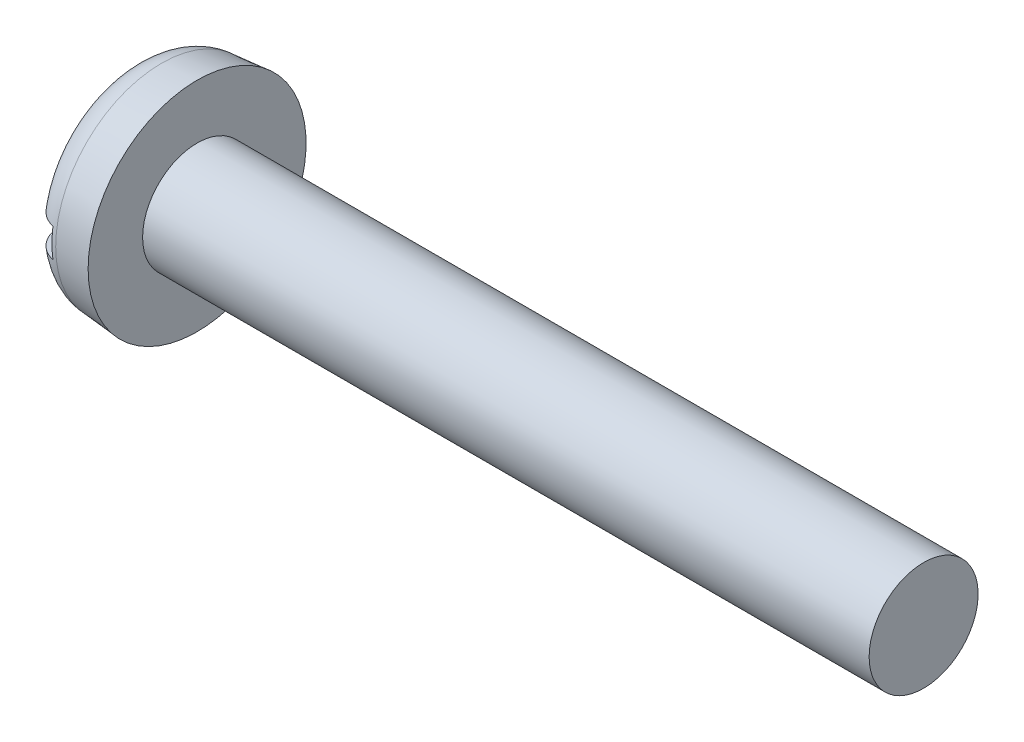
ISO-10303-21;
HEADER;
FILE_DESCRIPTION(('STEP AP214'),'2;1');
FILE_NAME('part.step','',(''),(''),'','','');
FILE_SCHEMA(('AUTOMOTIVE_DESIGN { 1 0 10303 214 1 1 1 1 }'));
ENDSEC;
DATA;
#1=APPLICATION_CONTEXT('core data for automotive mechanical design processes');
#2=APPLICATION_PROTOCOL_DEFINITION('international standard','automotive_design',2000,#1);
#3=PRODUCT_CONTEXT('',#1,'mechanical');
#4=PRODUCT('Part','Part','',(#3));
#5=PRODUCT_RELATED_PRODUCT_CATEGORY('part','',(#4));
#6=PRODUCT_DEFINITION_FORMATION('','',#4);
#7=PRODUCT_DEFINITION_CONTEXT('part definition',#1,'design');
#8=PRODUCT_DEFINITION('design','',#6,#7);
#9=PRODUCT_DEFINITION_SHAPE('','',#8);
#10=(LENGTH_UNIT() NAMED_UNIT(*) SI_UNIT(.MILLI.,.METRE.));
#11=(NAMED_UNIT(*) PLANE_ANGLE_UNIT() SI_UNIT($,.RADIAN.));
#12=(NAMED_UNIT(*) SI_UNIT($,.STERADIAN.) SOLID_ANGLE_UNIT());
#13=UNCERTAINTY_MEASURE_WITH_UNIT(LENGTH_MEASURE(1.E-05),#10,'distance_accuracy_value','');
#14=(GEOMETRIC_REPRESENTATION_CONTEXT(3) GLOBAL_UNCERTAINTY_ASSIGNED_CONTEXT((#13)) GLOBAL_UNIT_ASSIGNED_CONTEXT((#10,
#11,#12)) REPRESENTATION_CONTEXT('',''));
#15=CARTESIAN_POINT('',(0.,0.,0.));
#16=DIRECTION('',(0.,0.,1.));
#17=DIRECTION('',(1.,0.,0.));
#18=AXIS2_PLACEMENT_3D('',#15,#16,#17);
#19=CARTESIAN_POINT('',(0.,0.,0.));
#20=DIRECTION('',(-1.,0.,0.));
#21=DIRECTION('',(0.,0.,1.));
#22=AXIS2_PLACEMENT_3D('',#19,#20,#21);
#23=PLANE('',#22);
#24=DIRECTION('',(0.,0.,-1.));
#25=VECTOR('',#24,1.);
#26=CARTESIAN_POINT('',(0.,0.8,6.));
#27=LINE('',#26,#25);
#28=CARTESIAN_POINT('',(0.,0.8,3.9555566143216));
#29=VERTEX_POINT('',#28);
#30=CARTESIAN_POINT('',(0.,0.8,-3.9555566143216));
#31=VERTEX_POINT('',#30);
#32=EDGE_CURVE('E88',#29,#31,#27,.T.);
#33=ORIENTED_EDGE('',*,*,#32,.F.);
#34=CARTESIAN_POINT('',(0.,0.,0.));
#35=DIRECTION('',(-1.,0.,0.));
#36=DIRECTION('',(0.,0.,1.));
#37=AXIS2_PLACEMENT_3D('',#34,#35,#36);
#38=CIRCLE('',#37,4.03564469807531);
#39=EDGE_CURVE('E94',#29,#31,#38,.T.);
#40=ORIENTED_EDGE('',*,*,#39,.T.);
#41=EDGE_LOOP('',(#33,#40));
#42=FACE_BOUND('',#41,.T.);
#43=ADVANCED_FACE('F34',(#42),#23,.T.);
#44=CARTESIAN_POINT('',(-25.4,0.,0.));
#45=DIRECTION('',(-1.,0.,0.));
#46=DIRECTION('',(0.,0.,1.));
#47=AXIS2_PLACEMENT_3D('',#44,#45,#46);
#48=CYLINDRICAL_SURFACE('',#47,3.);
#49=CARTESIAN_POINT('',(43.6,0.,0.));
#50=DIRECTION('',(-1.,0.,0.));
#51=DIRECTION('',(0.,0.,1.));
#52=AXIS2_PLACEMENT_3D('',#49,#50,#51);
#53=CIRCLE('',#52,3.);
#54=CARTESIAN_POINT('',(43.6,0.,3.));
#55=VERTEX_POINT('',#54);
#56=EDGE_CURVE('E95',#55,#55,#53,.T.);
#57=ORIENTED_EDGE('',*,*,#56,.T.);
#58=EDGE_LOOP('',(#57));
#59=FACE_BOUND('',#58,.T.);
#60=CARTESIAN_POINT('',(3.6,0.,0.));
#61=DIRECTION('',(-1.,0.,0.));
#62=DIRECTION('',(0.,0.,1.));
#63=AXIS2_PLACEMENT_3D('',#60,#61,#62);
#64=CIRCLE('',#63,3.);
#65=CARTESIAN_POINT('',(3.6,0.,3.));
#66=VERTEX_POINT('',#65);
#67=EDGE_CURVE('E155',#66,#66,#64,.T.);
#68=ORIENTED_EDGE('',*,*,#67,.F.);
#69=EDGE_LOOP('',(#68));
#70=FACE_BOUND('',#69,.T.);
#71=ADVANCED_FACE('F143',(#59,#70),#48,.T.);
#72=CARTESIAN_POINT('',(43.6,3.,0.));
#73=DIRECTION('',(1.,0.,0.));
#74=DIRECTION('',(0.,0.,-1.));
#75=AXIS2_PLACEMENT_3D('',#72,#73,#74);
#76=PLANE('',#75);
#77=ORIENTED_EDGE('',*,*,#56,.F.);
#78=EDGE_LOOP('',(#77));
#79=FACE_BOUND('',#78,.T.);
#80=ADVANCED_FACE('F141',(#79),#76,.T.);
#81=DIRECTION('',(0.,0.,1.));
#82=VECTOR('',#81,1.);
#83=CARTESIAN_POINT('',(0.,-0.799999999999999,-6.));
#84=LINE('',#83,#82);
#85=CARTESIAN_POINT('',(0.,-0.799999999999999,-3.9555566143216));
#86=VERTEX_POINT('',#85);
#87=CARTESIAN_POINT('',(0.,-0.8,3.9555566143216));
#88=VERTEX_POINT('',#87);
#89=EDGE_CURVE('E79',#86,#88,#84,.T.);
#90=ORIENTED_EDGE('',*,*,#89,.F.);
#91=EDGE_CURVE('E86',#86,#88,#38,.T.);
#92=ORIENTED_EDGE('',*,*,#91,.T.);
#93=EDGE_LOOP('',(#90,#92));
#94=FACE_BOUND('',#93,.T.);
#95=ADVANCED_FACE('F85',(#94),#23,.T.);
#96=CARTESIAN_POINT('',(0.,0.,0.));
#97=DIRECTION('',(1.,0.,0.));
#98=DIRECTION('',(0.,0.,-1.));
#99=AXIS2_PLACEMENT_3D('',#96,#97,#98);
#100=CONICAL_SURFACE('',#99,5.68504081130667,0.0872664625997163);
#101=CARTESIAN_POINT('',(1.64311966305421,0.,0.));
#102=DIRECTION('',(-1.,0.,0.));
#103=DIRECTION('',(0.,0.,1.));
#104=AXIS2_PLACEMENT_3D('',#101,#102,#103);
#105=CIRCLE('',#104,5.82879515464045);
#106=CARTESIAN_POINT('',(1.64311966305421,0.,5.82879515464045));
#107=VERTEX_POINT('',#106);
#108=EDGE_CURVE('E98',#107,#107,#105,.F.);
#109=ORIENTED_EDGE('',*,*,#108,.T.);
#110=EDGE_LOOP('',(#109));
#111=FACE_BOUND('',#110,.T.);
#112=CARTESIAN_POINT('',(3.6,0.,0.));
#113=DIRECTION('',(-1.,0.,0.));
#114=DIRECTION('',(0.,0.,1.));
#115=AXIS2_PLACEMENT_3D('',#112,#113,#114);
#116=CIRCLE('',#115,6.);
#117=CARTESIAN_POINT('',(3.6,0.,6.));
#118=VERTEX_POINT('',#117);
#119=EDGE_CURVE('E100',#118,#118,#116,.T.);
#120=ORIENTED_EDGE('',*,*,#119,.T.);
#121=EDGE_LOOP('',(#120));
#122=FACE_BOUND('',#121,.T.);
#123=ADVANCED_FACE('F134',(#111,#122),#100,.T.);
#124=CARTESIAN_POINT('',(3.6,3.,0.));
#125=DIRECTION('',(-1.,0.,0.));
#126=DIRECTION('',(0.,0.,1.));
#127=AXIS2_PLACEMENT_3D('',#124,#125,#126);
#128=PLANE('',#127);
#129=ORIENTED_EDGE('',*,*,#119,.F.);
#130=EDGE_LOOP('',(#129));
#131=FACE_BOUND('',#130,.T.);
#132=ORIENTED_EDGE('',*,*,#67,.T.);
#133=EDGE_LOOP('',(#132));
#134=FACE_BOUND('',#133,.T.);
#135=ADVANCED_FACE('F130',(#131,#134),#128,.F.);
#136=CARTESIAN_POINT('',(1.8,0.,0.));
#137=DIRECTION('',(-1.,0.,0.));
#138=DIRECTION('',(0.,0.,1.));
#139=AXIS2_PLACEMENT_3D('',#136,#137,#138);
#140=TOROIDAL_SURFACE('',#139,4.03564469807531,1.8);
#141=CARTESIAN_POINT('',(0.79498247877104,0.8,-5.4707595964476));
#142=CARTESIAN_POINT('',(0.878021781411494,0.8,-5.52723570221117));
#143=CARTESIAN_POINT('',(0.965868273071982,0.8,-5.57676892397787));
#144=CARTESIAN_POINT('',(1.14869741387493,0.8,-5.66043534254259));
#145=CARTESIAN_POINT('',(1.24368800154579,0.8,-5.69455110348362));
#146=CARTESIAN_POINT('',(1.43803558818996,0.8,-5.74631528666983));
#147=CARTESIAN_POINT('',(1.53739129870275,0.8,-5.76396853443929));
#148=CARTESIAN_POINT('',(1.73763141508807,0.8,-5.78229150097843));
#149=CARTESIAN_POINT('',(1.83851545303786,0.8,-5.78296524429698));
#150=CARTESIAN_POINT('',(2.03871866229868,0.8,-5.76734047129323));
#151=CARTESIAN_POINT('',(2.13804097979698,0.8,-5.75108223962724));
#152=CARTESIAN_POINT('',(2.33255211629057,0.8,-5.70213397568044));
#153=CARTESIAN_POINT('',(2.42774081078532,0.8,-5.66944344884793));
#154=CARTESIAN_POINT('',(2.61137767784059,0.8,-5.58855650320202));
#155=CARTESIAN_POINT('',(2.69982013812151,0.8,-5.54034712040219));
#156=CARTESIAN_POINT('',(2.86741127340005,0.8,-5.42983917453441));
#157=CARTESIAN_POINT('',(2.94655981033097,0.8,-5.36754040220049));
#158=CARTESIAN_POINT('',(3.09379162808112,0.8,-5.23028659428212));
#159=CARTESIAN_POINT('',(3.16181323628872,0.8,-5.15526542146274));
#160=CARTESIAN_POINT('',(3.28444297285228,0.8,-4.99496665221733));
#161=CARTESIAN_POINT('',(3.33905060522622,0.8,-4.90968867671944));
#162=CARTESIAN_POINT('',(3.43391817009173,0.8,-4.73039134361488));
#163=CARTESIAN_POINT('',(3.47402767397714,0.8,-4.63629242164483));
#164=CARTESIAN_POINT('',(3.53813466297284,0.8,-4.44276184996656));
#165=CARTESIAN_POINT('',(3.5621310939402,0.8,-4.34332985181943));
#166=CARTESIAN_POINT('',(3.59373390423442,0.8,-4.14038478092645));
#167=CARTESIAN_POINT('',(3.60109179791735,0.8,-4.03683304431231));
#168=CARTESIAN_POINT('',(3.59864586257367,0.8,-3.82993528637962));
#169=CARTESIAN_POINT('',(3.5888404341772,0.8,-3.72658928513103));
#170=CARTESIAN_POINT('',(3.55214929440373,0.8,-3.52104210968037));
#171=CARTESIAN_POINT('',(3.52495742207498,0.8,-3.41889557837248));
#172=CARTESIAN_POINT('',(3.45407385845243,0.8,-3.22049320619653));
#173=CARTESIAN_POINT('',(3.41038022282177,0.8,-3.12423806104062));
#174=CARTESIAN_POINT('',(3.30693931611536,0.8,-2.93884573268063));
#175=CARTESIAN_POINT('',(3.24695855328808,0.8,-2.84983868909483));
#176=CARTESIAN_POINT('',(3.11285703415794,0.8,-2.6831725066266));
#177=CARTESIAN_POINT('',(3.03873462072239,0.8,-2.60551469954426));
#178=CARTESIAN_POINT('',(2.87857461311779,0.8,-2.46428120766053));
#179=CARTESIAN_POINT('',(2.79258245563154,0.8,-2.4006541183588));
#180=CARTESIAN_POINT('',(2.61075841872466,0.8,-2.2894705599418));
#181=CARTESIAN_POINT('',(2.51492959066773,0.8,-2.24190912673876));
#182=CARTESIAN_POINT('',(2.32040408907388,0.8,-2.16659600115229));
#183=CARTESIAN_POINT('',(2.22199896443323,0.8,-2.13809322445314));
#184=CARTESIAN_POINT('',(2.02168808214052,0.8,-2.09919204844837));
#185=CARTESIAN_POINT('',(1.91978414307377,0.8,-2.08878438484009));
#186=CARTESIAN_POINT('',(1.7218106948707,0.8,-2.08668375889815));
#187=CARTESIAN_POINT('',(1.62575089910533,0.8,-2.09392507457572));
#188=CARTESIAN_POINT('',(1.43624947629456,0.8,-2.12455680048217));
#189=CARTESIAN_POINT('',(1.34280792595818,0.8,-2.14794768334539));
#190=CARTESIAN_POINT('',(1.16164281790279,0.8,-2.20963276873043));
#191=CARTESIAN_POINT('',(1.0738881380438,0.8,-2.24783612052104));
#192=CARTESIAN_POINT('',(0.905572242928248,0.8,-2.33769901400144));
#193=CARTESIAN_POINT('',(0.825012624363653,0.8,-2.38936153256813));
#194=CARTESIAN_POINT('',(0.668796736037328,0.8,-2.50758066564676));
#195=CARTESIAN_POINT('',(0.593629818054888,0.8,-2.57478377070901));
#196=CARTESIAN_POINT('',(0.454960475513755,0.8,-2.72030593840466));
#197=CARTESIAN_POINT('',(0.391460875977256,0.8,-2.79862768509224));
#198=CARTESIAN_POINT('',(0.274732833001984,0.8,-2.9684902514541));
#199=CARTESIAN_POINT('',(0.222182729327836,0.8,-3.06049816269765));
#200=CARTESIAN_POINT('',(0.133007999981065,0.8,-3.25193849717045));
#201=CARTESIAN_POINT('',(0.0963850552592114,0.8,-3.35137170276757));
#202=CARTESIAN_POINT('',(0.0397382861104145,0.8,-3.55644918655703));
#203=CARTESIAN_POINT('',(0.0199665449510404,0.8,-3.66216331118301));
#204=CARTESIAN_POINT('',(-0.00133707228954608,0.8,-3.87541473590194));
#205=CARTESIAN_POINT('',(-0.00287033898764957,0.8,-3.98295189636897));
#206=CARTESIAN_POINT('',(0.0124328442644739,0.8,-4.19551973339952));
#207=CARTESIAN_POINT('',(0.0290662406091843,0.8,-4.3005649778431));
#208=CARTESIAN_POINT('',(0.0800769807812615,0.8,-4.50628962346019));
#209=CARTESIAN_POINT('',(0.114457174703788,0.8,-4.60696832056003));
#210=CARTESIAN_POINT('',(0.199309446403618,0.8,-4.79913251927606));
#211=CARTESIAN_POINT('',(0.249482144961682,0.8,-4.89075042342882));
#212=CARTESIAN_POINT('',(0.364709888648773,0.8,-5.06398311276304));
#213=CARTESIAN_POINT('',(0.429745119549729,0.8,-5.14561099580298));
#214=CARTESIAN_POINT('',(0.545565767507795,0.8,-5.26772828516504));
#215=CARTESIAN_POINT('',(0.59237011211439,0.8,-5.31206032585229));
#216=CARTESIAN_POINT('',(0.690451457372831,0.8,-5.39546656824515));
#217=CARTESIAN_POINT('',(0.741728416572756,0.8,-5.43454081867111));
#218=CARTESIAN_POINT('',(0.79498247877104,0.8,-5.4707595964476));
#219=B_SPLINE_CURVE_WITH_KNOTS('',3,(#141,#142,#143,#144,#145,#146,#147,#148,#149,#150,#151,
#152,#153,#154,#155,#156,#157,#158,#159,#160,#161,#162,#163,#164,#165,#166,#167,#168,#169,#170,
#171,#172,#173,#174,#175,#176,#177,#178,#179,#180,#181,#182,#183,#184,#185,#186,#187,#188,#189,
#190,#191,#192,#193,#194,#195,#196,#197,#198,#199,#200,#201,#202,#203,#204,#205,#206,#207,#208,
#209,#210,#211,#212,#213,#214,#215,#216,#217,#218),.UNSPECIFIED.,.T.,.F.,(4,2,2,2,2,2,2,2,2,2,2,
2,2,2,2,2,2,2,2,2,2,2,2,2,2,2,2,2,2,2,2,2,2,2,2,2,2,2,4),(0.,0.301039686168182,
0.602418976222948,0.903709897593573,1.20492940513451,1.50543388308322,1.80594740565397,
2.10671262252155,2.40748230686831,2.7098663617838,3.01226159567311,3.31770997067085,
3.62317832664211,3.933179344494,4.24320925143138,4.5588547812091,4.87453751384788,
5.1950094379763,5.51551893841425,5.83483392038979,6.15405014756491,6.4597992379228,
6.76539174527842,7.05299302358865,7.34060271921432,7.62647560561728,7.91241177468609,
8.21357015550234,8.51480136035,8.8312033120299,9.14763864864129,9.46872849100686,
9.78979385129078,10.1073069663005,10.4248710890632,10.7367449710122,11.0482054739601,
11.241267484682,11.434327706307),.UNSPECIFIED.);
#220=CARTESIAN_POINT('',(1.4,0.8,-5.73510972270059));
#221=VERTEX_POINT('',#220);
#222=EDGE_CURVE('E11',#31,#221,#219,.T.);
#223=ORIENTED_EDGE('',*,*,#222,.F.);
#224=ORIENTED_EDGE('',*,*,#39,.F.);
#225=CARTESIAN_POINT('',(0.738808862755957,0.8,2.45465275891893));
#226=CARTESIAN_POINT('',(0.81728090395036,0.8,2.39441521192629));
#227=CARTESIAN_POINT('',(0.900642588840665,0.8,2.34046573065824));
#228=CARTESIAN_POINT('',(1.07517756229069,0.8,2.24701568938401));
#229=CARTESIAN_POINT('',(1.16635530406727,0.8,2.2075234348571));
#230=CARTESIAN_POINT('',(1.35433647815522,0.8,2.14457447392871));
#231=CARTESIAN_POINT('',(1.4511512693026,0.8,2.12115145252577));
#232=CARTESIAN_POINT('',(1.64736626373892,0.8,2.09163161655544));
#233=CARTESIAN_POINT('',(1.74676535350718,0.8,2.08552746052977));
#234=CARTESIAN_POINT('',(1.94139815793727,0.8,2.09084288212209));
#235=CARTESIAN_POINT('',(2.0366500341865,0.8,2.10162308145853));
#236=CARTESIAN_POINT('',(2.22399259794412,0.8,2.13900058336874));
#237=CARTESIAN_POINT('',(2.3160829104002,0.8,2.16559975571637));
#238=CARTESIAN_POINT('',(2.49488785579145,0.8,2.23354429270444));
#239=CARTESIAN_POINT('',(2.58158846760124,0.8,2.2749263725107));
#240=CARTESIAN_POINT('',(2.74733008688126,0.8,2.37090149346887));
#241=CARTESIAN_POINT('',(2.82636936516146,0.8,2.4254975073737));
#242=CARTESIAN_POINT('',(2.97924384982255,0.8,2.54961694240126));
#243=CARTESIAN_POINT('',(3.05253911653726,0.8,2.61980548905359));
#244=CARTESIAN_POINT('',(3.18697089391559,0.8,2.77099535869646));
#245=CARTESIAN_POINT('',(3.24810458603162,0.8,2.85199918096601));
#246=CARTESIAN_POINT('',(3.35932367863329,0.8,3.02670877873326));
#247=CARTESIAN_POINT('',(3.40875290295072,0.8,3.12083317145552));
#248=CARTESIAN_POINT('',(3.49131343176022,0.8,3.31598315842183));
#249=CARTESIAN_POINT('',(3.5244433294817,0.8,3.41700934749294));
#250=CARTESIAN_POINT('',(3.57365832967891,0.8,3.62432183899235));
#251=CARTESIAN_POINT('',(3.58955155354412,0.8,3.73065384290518));
#252=CARTESIAN_POINT('',(3.60301925049771,0.8,3.94447654621399));
#253=CARTESIAN_POINT('',(3.6005945965361,0.8,4.05196719015045));
#254=CARTESIAN_POINT('',(3.57746920438561,0.8,4.26360682524416));
#255=CARTESIAN_POINT('',(3.55699765445138,0.8,4.36778080439547));
#256=CARTESIAN_POINT('',(3.49852167745952,0.8,4.57108923497054));
#257=CARTESIAN_POINT('',(3.46051891571931,0.8,4.67022416406882));
#258=CARTESIAN_POINT('',(3.36882575300776,0.8,4.85868839782682));
#259=CARTESIAN_POINT('',(3.31543802821706,0.8,4.9481649794392));
#260=CARTESIAN_POINT('',(3.1941696976945,0.8,5.11669149310859));
#261=CARTESIAN_POINT('',(3.12629038111124,0.8,5.19574235160981));
#262=CARTESIAN_POINT('',(2.97914164788937,0.8,5.33986050304074));
#263=CARTESIAN_POINT('',(2.90006974283139,0.8,5.40512951313778));
#264=CARTESIAN_POINT('',(2.73198870926708,0.8,5.52128982481106));
#265=CARTESIAN_POINT('',(2.64298022208824,0.8,5.57218205354675));
#266=CARTESIAN_POINT('',(2.45861045172921,0.8,5.65758147057975));
#267=CARTESIAN_POINT('',(2.36332949666704,0.8,5.6922621433757));
#268=CARTESIAN_POINT('',(2.16827799846028,0.8,5.74502563142979));
#269=CARTESIAN_POINT('',(2.06850763162037,0.8,5.76310909788479));
#270=CARTESIAN_POINT('',(1.8679544932308,0.8,5.78208130821785));
#271=CARTESIAN_POINT('',(1.76718145389007,0.8,5.78307307619952));
#272=CARTESIAN_POINT('',(1.5669047405792,0.8,5.7680972223928));
#273=CARTESIAN_POINT('',(1.4674010466573,0.8,5.75212986750365));
#274=CARTESIAN_POINT('',(1.27263042539357,0.8,5.70374269353348));
#275=CARTESIAN_POINT('',(1.17735767343021,0.8,5.67134630691868));
#276=CARTESIAN_POINT('',(0.993580598251401,0.8,5.59106523356246));
#277=CARTESIAN_POINT('',(0.905076306964469,0.8,5.54318047376411));
#278=CARTESIAN_POINT('',(0.73704277782332,0.8,5.43315060198027));
#279=CARTESIAN_POINT('',(0.657541732800566,0.8,5.37096244781723));
#280=CARTESIAN_POINT('',(0.51001197867511,0.8,5.23421401355587));
#281=CARTESIAN_POINT('',(0.441983591122382,0.8,5.15965338680417));
#282=CARTESIAN_POINT('',(0.318749447897985,0.8,4.99968518214277));
#283=CARTESIAN_POINT('',(0.263645836994494,0.8,4.91419893921519));
#284=CARTESIAN_POINT('',(0.168372115433642,0.8,4.73527874468894));
#285=CARTESIAN_POINT('',(0.12820281746382,0.8,4.64184436091241));
#286=CARTESIAN_POINT('',(0.0633758760382894,0.8,4.44844396926919));
#287=CARTESIAN_POINT('',(0.0389181726903435,0.8,4.34841097418927));
#288=CARTESIAN_POINT('',(0.00684497615367615,0.8,4.14568821972825));
#289=CARTESIAN_POINT('',(-0.000769843685637645,0.8,4.0429983542961));
#290=CARTESIAN_POINT('',(0.000906696644069946,0.8,3.83604122241814));
#291=CARTESIAN_POINT('',(0.0104828796453908,0.8,3.73177629209953));
#292=CARTESIAN_POINT('',(0.0466864843917509,0.8,3.52622451606567));
#293=CARTESIAN_POINT('',(0.0733195200020884,0.8,3.42493866232764));
#294=CARTESIAN_POINT('',(0.143440652938328,0.8,3.22628956859382));
#295=CARTESIAN_POINT('',(0.187229198277411,0.8,3.12903247421492));
#296=CARTESIAN_POINT('',(0.290347973800745,0.8,2.94321898474456));
#297=CARTESIAN_POINT('',(0.349664024043149,0.8,2.85465475214756));
#298=CARTESIAN_POINT('',(0.463120486540268,0.8,2.71261986375551));
#299=CARTESIAN_POINT('',(0.513841235261762,0.8,2.6563828294548));
#300=CARTESIAN_POINT('',(0.621691862489933,0.8,2.5504233045694));
#301=CARTESIAN_POINT('',(0.678821685219908,0.8,2.50070075729878));
#302=CARTESIAN_POINT('',(0.738808862755957,0.8,2.45465275891893));
#303=B_SPLINE_CURVE_WITH_KNOTS('',3,(#225,#226,#227,#228,#229,#230,#231,#232,#233,#234,#235,
#236,#237,#238,#239,#240,#241,#242,#243,#244,#245,#246,#247,#248,#249,#250,#251,#252,#253,#254,
#255,#256,#257,#258,#259,#260,#261,#262,#263,#264,#265,#266,#267,#268,#269,#270,#271,#272,#273,
#274,#275,#276,#277,#278,#279,#280,#281,#282,#283,#284,#285,#286,#287,#288,#289,#290,#291,#292,
#293,#294,#295,#296,#297,#298,#299,#300,#301,#302),.UNSPECIFIED.,.T.,.F.,(4,2,2,2,2,2,2,2,2,2,2,
2,2,2,2,2,2,2,2,2,2,2,2,2,2,2,2,2,2,2,2,2,2,2,2,2,2,2,4),(0.,0.296525421879765,
0.593220927221168,0.890536493145869,1.18772600830897,1.4739307093563,1.76016924600428,
2.0471236910243,2.33414275259769,2.63724803752002,2.94042348802224,3.25788178582408,
3.57536747817383,3.89635224970986,4.21732172461102,4.53427280846465,4.85119379083326,
5.16226196234397,5.47330247325445,5.77941469908211,6.08550717920575,6.38824453070312,
6.69097000369295,6.99187008741655,7.29276543570569,7.59323282372481,7.89370162903606,
8.19508672548803,8.49648026760921,8.80018100172884,9.10389826005622,9.4114077171392,
9.71892946769725,10.0315933889897,10.3443602692422,10.6628688953917,10.9810876634535,
11.2077655686962,11.4344415013661),.UNSPECIFIED.);
#304=CARTESIAN_POINT('',(1.4,0.8,5.73510972270059));
#305=VERTEX_POINT('',#304);
#306=EDGE_CURVE('E113',#305,#29,#303,.T.);
#307=ORIENTED_EDGE('',*,*,#306,.F.);
#308=CARTESIAN_POINT('',(1.4,0.,0.));
#309=DIRECTION('',(-1.,0.,0.));
#310=DIRECTION('',(0.,0.,1.));
#311=AXIS2_PLACEMENT_3D('',#308,#309,#310);
#312=CIRCLE('',#311,5.79063757555374);
#313=CARTESIAN_POINT('',(1.4,-0.800000000000001,5.73510972270059));
#314=VERTEX_POINT('',#313);
#315=EDGE_CURVE('E106',#305,#314,#312,.F.);
#316=ORIENTED_EDGE('',*,*,#315,.T.);
#317=CARTESIAN_POINT('',(0.738808862755957,-0.8,2.45465275891893));
#318=CARTESIAN_POINT('',(0.654650583055117,-0.8,2.51926355200935));
#319=CARTESIAN_POINT('',(0.575997154507916,-0.8,2.59120474064522));
#320=CARTESIAN_POINT('',(0.431815168763476,-0.8,2.74736316186492));
#321=CARTESIAN_POINT('',(0.36631031753961,-0.8,2.8316021025952));
#322=CARTESIAN_POINT('',(0.250316246376519,-0.8,3.009705251625));
#323=CARTESIAN_POINT('',(0.199807521812913,-0.8,3.10355674170627));
#324=CARTESIAN_POINT('',(0.115117819347704,-0.8,3.29830977965815));
#325=CARTESIAN_POINT('',(0.0809300590553323,-0.8,3.3992083789932));
#326=CARTESIAN_POINT('',(0.0296583318607302,-0.8,3.60624688426383));
#327=CARTESIAN_POINT('',(0.0127325581965296,-0.8,3.71242607640928));
#328=CARTESIAN_POINT('',(-0.00282059226024313,-0.8,3.92613069484577));
#329=CARTESIAN_POINT('',(-0.00144724951808501,-0.8,4.03365617390772));
#330=CARTESIAN_POINT('',(0.0196066503939876,-0.8,4.24558329071084));
#331=CARTESIAN_POINT('',(0.0390643203732083,-0.8,4.35000701693892));
#332=CARTESIAN_POINT('',(0.0955698891766116,-0.8,4.55398403037389));
#333=CARTESIAN_POINT('',(0.132615965613485,-0.800000000000001,4.65353782099084));
#334=CARTESIAN_POINT('',(0.222500685271957,-0.800000000000001,4.84299035279221));
#335=CARTESIAN_POINT('',(0.275035271322079,-0.800000000000001,4.93303336698085));
#336=CARTESIAN_POINT('',(0.394708301490632,-0.800000000000001,5.10282845383517));
#337=CARTESIAN_POINT('',(0.461845417248886,-0.800000000000001,5.18258146150956));
#338=CARTESIAN_POINT('',(0.607645323476716,-0.800000000000001,5.32819694031435));
#339=CARTESIAN_POINT('',(0.686106942121359,-0.800000000000001,5.39426088983188));
#340=CARTESIAN_POINT('',(0.853112769851129,-0.800000000000001,5.51210096889903));
#341=CARTESIAN_POINT('',(0.941656334167567,-0.800000000000001,5.56387801141222));
#342=CARTESIAN_POINT('',(1.12524607600852,-0.800000000000001,5.6510932518933));
#343=CARTESIAN_POINT('',(1.22020911334482,-0.800000000000001,5.68670652436378));
#344=CARTESIAN_POINT('',(1.41478737039854,-0.800000000000001,5.74137307155477));
#345=CARTESIAN_POINT('',(1.51440240195487,-0.800000000000001,5.76042701544689));
#346=CARTESIAN_POINT('',(1.71479811916751,-0.800000000000001,5.78134157318957));
#347=CARTESIAN_POINT('',(1.81556783088549,-0.800000000000001,5.78330747099474));
#348=CARTESIAN_POINT('',(2.01600141400791,-0.800000000000001,5.77026427909424));
#349=CARTESIAN_POINT('',(2.11566530359843,-0.800000000000001,5.75525546896959));
#350=CARTESIAN_POINT('',(2.31090109323454,-0.800000000000001,5.70874330749071));
#351=CARTESIAN_POINT('',(2.40647909983843,-0.800000000000001,5.67726557367507));
#352=CARTESIAN_POINT('',(2.59101515513862,-0.800000000000001,5.5987556915629));
#353=CARTESIAN_POINT('',(2.6799731723359,-0.800000000000001,5.55172346926131));
#354=CARTESIAN_POINT('',(2.84903871310012,-0.800000000000001,5.44331774507961));
#355=CARTESIAN_POINT('',(2.92911962412076,-0.800000000000001,5.38190275174589));
#356=CARTESIAN_POINT('',(3.07792799416342,-0.800000000000001,5.24659163238861));
#357=CARTESIAN_POINT('',(3.14665515144413,-0.800000000000001,5.17269517475887));
#358=CARTESIAN_POINT('',(3.27138174251225,-0.800000000000001,5.01394352244095));
#359=CARTESIAN_POINT('',(3.3272815438209,-0.800000000000001,4.9290100729891));
#360=CARTESIAN_POINT('',(3.42422579657859,-0.800000000000001,4.75105518441382));
#361=CARTESIAN_POINT('',(3.46526950944318,-0.8,4.65803334345342));
#362=CARTESIAN_POINT('',(3.53190401728387,-0.8,4.46532684164714));
#363=CARTESIAN_POINT('',(3.55729802608939,-0.8,4.36557416709264));
#364=CARTESIAN_POINT('',(3.59127645137186,-0.8,4.1632497054257));
#365=CARTESIAN_POINT('',(3.5998595424972,-0.8,4.06067769668687));
#366=CARTESIAN_POINT('',(3.60013933774861,-0.8,3.85379739111221));
#367=CARTESIAN_POINT('',(3.59155138006068,-0.8,3.74948873071031));
#368=CARTESIAN_POINT('',(3.5573082981875,-0.8,3.54371261301965));
#369=CARTESIAN_POINT('',(3.53165142447631,-0.8,3.44224544808895));
#370=CARTESIAN_POINT('',(3.46346864050295,-0.8,3.24309833787712));
#371=CARTESIAN_POINT('',(3.42064732476672,-0.8,3.14551947320841));
#372=CARTESIAN_POINT('',(3.31938145930648,-0.8,2.95882192492474));
#373=CARTESIAN_POINT('',(3.2609347742414,-0.8,2.869704399882));
#374=CARTESIAN_POINT('',(3.12937338988563,-0.8,2.70170920822213));
#375=CARTESIAN_POINT('',(3.05612986304229,-0.8,2.62293226860331));
#376=CARTESIAN_POINT('',(2.8972168945846,-0.8,2.47906700491505));
#377=CARTESIAN_POINT('',(2.81154754330461,-0.8,2.41397858134005));
#378=CARTESIAN_POINT('',(2.63189040045543,-0.8,2.30102582091958));
#379=CARTESIAN_POINT('',(2.53810397909863,-0.8,2.25284212510418));
#380=CARTESIAN_POINT('',(2.34344297143819,-0.8,2.17400509511495));
#381=CARTESIAN_POINT('',(2.24257253716404,-0.8,2.14334158685309));
#382=CARTESIAN_POINT('',(2.04279712186911,-0.8,2.10230574896057));
#383=CARTESIAN_POINT('',(1.94410975503258,-0.8,2.09087307915656));
#384=CARTESIAN_POINT('',(1.74624615337143,-0.8,2.08555744033791));
#385=CARTESIAN_POINT('',(1.64706991502979,-0.8,2.09167459776435));
#386=CARTESIAN_POINT('',(1.45542384334905,-0.8,2.12051019981731));
#387=CARTESIAN_POINT('',(1.3628466234854,-0.8,2.14252778306014));
#388=CARTESIAN_POINT('',(1.18262126888773,-0.8,2.20137783147465));
#389=CARTESIAN_POINT('',(1.09496796407233,-0.8,2.23819441338274));
#390=CARTESIAN_POINT('',(0.963037962464619,-0.8,2.30638349216341));
#391=CARTESIAN_POINT('',(0.916369023755198,-0.8,2.3332465613576));
#392=CARTESIAN_POINT('',(0.825597706014433,-0.8,2.39099554147401));
#393=CARTESIAN_POINT('',(0.781495176879087,-0.8,2.42188121677945));
#394=CARTESIAN_POINT('',(0.738808862755957,-0.8,2.45465275891893));
#395=B_SPLINE_CURVE_WITH_KNOTS('',3,(#317,#318,#319,#320,#321,#322,#323,#324,#325,#326,#327,
#328,#329,#330,#331,#332,#333,#334,#335,#336,#337,#338,#339,#340,#341,#342,#343,#344,#345,#346,
#347,#348,#349,#350,#351,#352,#353,#354,#355,#356,#357,#358,#359,#360,#361,#362,#363,#364,#365,
#366,#367,#368,#369,#370,#371,#372,#373,#374,#375,#376,#377,#378,#379,#380,#381,#382,#383,#384,
#385,#386,#387,#388,#389,#390,#391,#392,#393,#394),.UNSPECIFIED.,.T.,.F.,(4,2,2,2,2,2,2,2,2,2,2,
2,2,2,2,2,2,2,2,2,2,2,2,2,2,2,2,2,2,2,2,2,2,2,2,2,2,2,4),(0.,0.318096966555204,
0.636762388022819,0.955011504993438,1.27312825399636,1.5941347977512,1.91515396375694,
2.23226833960722,2.54934986545845,2.86057987462294,3.17178158370673,3.47801376370799,
3.78422637029096,4.08703814654055,4.38983768543022,4.69077026406685,4.99169788628148,
5.29215879886352,5.59262114099759,5.89396117349583,6.19530921322313,6.49892412268796,
6.80255412458165,7.1099281031531,7.41732631372756,7.7298628252778,8.04243137606175,
8.36062764356313,8.67886741756838,9.0000075854677,9.32114541883081,9.63584044474821,
9.95035253897744,10.2468743381193,10.5433982736144,10.8275926757549,11.1114828726278,
11.272835767465,11.4341792155994),.UNSPECIFIED.);
#396=EDGE_CURVE('E93',#88,#314,#395,.T.);
#397=ORIENTED_EDGE('',*,*,#396,.F.);
#398=ORIENTED_EDGE('',*,*,#91,.F.);
#399=CARTESIAN_POINT('',(0.79498247877104,-0.799999999999999,-5.4707595964476));
#400=CARTESIAN_POINT('',(0.710907891323877,-0.799999999999999,-5.41356815358587));
#401=CARTESIAN_POINT('',(0.631636792734366,-0.799999999999999,-5.34917273049206));
#402=CARTESIAN_POINT('',(0.485010326699633,-0.799999999999999,-5.20788964596421));
#403=CARTESIAN_POINT('',(0.417670906107772,-0.799999999999999,-5.13098552571741));
#404=CARTESIAN_POINT('',(0.296888380145856,-0.799999999999999,-4.96705901425213));
#405=CARTESIAN_POINT('',(0.243431497628102,-0.799999999999999,-4.88004677952456));
#406=CARTESIAN_POINT('',(0.151745205646662,-0.799999999999999,-4.69837825189746));
#407=CARTESIAN_POINT('',(0.113511967409671,-0.799999999999999,-4.6037238882189));
#408=CARTESIAN_POINT('',(0.0528834531892175,-0.799999999999999,-4.40846960986465));
#409=CARTESIAN_POINT('',(0.0306450595596877,-0.799999999999999,-4.30782101449094));
#410=CARTESIAN_POINT('',(0.00307493878516673,-0.799999999999999,-4.10423364300225));
#411=CARTESIAN_POINT('',(-0.00225473294801675,-0.799999999999999,-4.00129458999238));
#412=CARTESIAN_POINT('',(0.00403799739584608,-0.799999999999999,-3.79418040397016));
#413=CARTESIAN_POINT('',(0.0159509657148701,-0.8,-3.69001411831486));
#414=CARTESIAN_POINT('',(0.0567787653112254,-0.8,-3.48506907005109));
#415=CARTESIAN_POINT('',(0.0856953626478656,-0.8,-3.38429066046947));
#416=CARTESIAN_POINT('',(0.160302424847598,-0.8,-3.18709231927843));
#417=CARTESIAN_POINT('',(0.20628160150372,-0.8,-3.09078154558585));
#418=CARTESIAN_POINT('',(0.313636026750759,-0.8,-2.90714440962693));
#419=CARTESIAN_POINT('',(0.375013360652988,-0.8,-2.81981926650946));
#420=CARTESIAN_POINT('',(0.512046260293362,-0.8,-2.65608314481877));
#421=CARTESIAN_POINT('',(0.587803081785792,-0.8,-2.57975676239328));
#422=CARTESIAN_POINT('',(0.751330376374635,-0.8,-2.44125203686856));
#423=CARTESIAN_POINT('',(0.839100200104579,-0.8,-2.37907292951746));
#424=CARTESIAN_POINT('',(1.02206633912813,-0.8,-2.2725165647621));
#425=CARTESIAN_POINT('',(1.1170344531487,-0.8,-2.22774862958171));
#426=CARTESIAN_POINT('',(1.31344292854339,-0.8,-2.15594100494522));
#427=CARTESIAN_POINT('',(1.41487965549416,-0.8,-2.12889145496631));
#428=CARTESIAN_POINT('',(1.61491882110146,-0.8,-2.09494929717525));
#429=CARTESIAN_POINT('',(1.71333611414886,-0.8,-2.08696295121274));
#430=CARTESIAN_POINT('',(1.9100385143274,-0.8,-2.08833434327531));
#431=CARTESIAN_POINT('',(2.00832364459925,-0.8,-2.0976884923045));
#432=CARTESIAN_POINT('',(2.19822111943174,-0.8,-2.13259379476932));
#433=CARTESIAN_POINT('',(2.28994603514312,-0.8,-2.15753980272288));
#434=CARTESIAN_POINT('',(2.46812389762464,-0.8,-2.22198466663684));
#435=CARTESIAN_POINT('',(2.55457589924743,-0.8,-2.2614861227164));
#436=CARTESIAN_POINT('',(2.72291323352503,-0.8,-2.35511870956095));
#437=CARTESIAN_POINT('',(2.80455290045133,-0.8,-2.40969056063492));
#438=CARTESIAN_POINT('',(2.95818485453464,-0.8,-2.53104113185355));
#439=CARTESIAN_POINT('',(3.03017474151008,-0.8,-2.59782287922699));
#440=CARTESIAN_POINT('',(3.16684972907403,-0.8,-2.7459880769244));
#441=CARTESIAN_POINT('',(3.23085427169728,-0.8,-2.82800012560218));
#442=CARTESIAN_POINT('',(3.34469042679389,-0.8,-3.0013372886757));
#443=CARTESIAN_POINT('',(3.39451951793786,-0.8,-3.09266405592271));
#444=CARTESIAN_POINT('',(3.47999879247641,-0.8,-3.28515109111578));
#445=CARTESIAN_POINT('',(3.51516128327077,-0.8,-3.38652849551075));
#446=CARTESIAN_POINT('',(3.56793278653316,-0.8,-3.59375906551803));
#447=CARTESIAN_POINT('',(3.58554152761552,-0.799999999999999,-3.6996123003015));
#448=CARTESIAN_POINT('',(3.60253267192658,-0.799999999999999,-3.91255666810797));
#449=CARTESIAN_POINT('',(3.60195332971081,-0.799999999999999,-4.01964472945692));
#450=CARTESIAN_POINT('',(3.58250136913395,-0.799999999999999,-4.23215040977986));
#451=CARTESIAN_POINT('',(3.56363020016857,-0.799999999999999,-4.3375681604322));
#452=CARTESIAN_POINT('',(3.50845655001546,-0.799999999999999,-4.541832290491));
#453=CARTESIAN_POINT('',(3.47245352282421,-0.799999999999999,-4.64075953021548));
#454=CARTESIAN_POINT('',(3.38405219361766,-0.799999999999999,-4.83099829100706));
#455=CARTESIAN_POINT('',(3.33165544184455,-0.799999999999999,-4.92231053113882));
#456=CARTESIAN_POINT('',(3.21297961094559,-0.799999999999999,-5.09300071142656));
#457=CARTESIAN_POINT('',(3.14696502206293,-0.799999999999999,-5.17256258245392));
#458=CARTESIAN_POINT('',(3.00234707732374,-0.799999999999999,-5.31927970359609));
#459=CARTESIAN_POINT('',(2.92374468747096,-0.799999999999999,-5.38643590488672));
#460=CARTESIAN_POINT('',(2.75735615533563,-0.799999999999999,-5.50548196335812));
#461=CARTESIAN_POINT('',(2.66971064868928,-0.799999999999999,-5.55756844228502));
#462=CARTESIAN_POINT('',(2.4868646574207,-0.799999999999999,-5.64613551498809));
#463=CARTESIAN_POINT('',(2.39166488217978,-0.799999999999999,-5.68261757204168));
#464=CARTESIAN_POINT('',(2.19731523311712,-0.799999999999999,-5.73863546208328));
#465=CARTESIAN_POINT('',(2.09820754196021,-0.799999999999999,-5.75831774018658));
#466=CARTESIAN_POINT('',(1.89806476285629,-0.799999999999999,-5.78069531913944));
#467=CARTESIAN_POINT('',(1.79702923537925,-0.799999999999999,-5.78338669865177));
#468=CARTESIAN_POINT('',(1.59630713762877,-0.799999999999999,-5.7717182772957));
#469=CARTESIAN_POINT('',(1.49661713234888,-0.799999999999999,-5.75741684613152));
#470=CARTESIAN_POINT('',(1.3011428703224,-0.799999999999999,-5.71228636037468));
#471=CARTESIAN_POINT('',(1.20535385768217,-0.799999999999999,-5.68147812119757));
#472=CARTESIAN_POINT('',(1.05716264119848,-0.799999999999999,-5.61967030184329));
#473=CARTESIAN_POINT('',(1.00264579680923,-0.799999999999999,-5.59361192627646));
#474=CARTESIAN_POINT('',(0.89651564870589,-0.799999999999999,-5.53613546862752));
#475=CARTESIAN_POINT('',(0.844902335653026,-0.799999999999999,-5.50471740378536));
#476=CARTESIAN_POINT('',(0.79498247877104,-0.799999999999999,-5.4707595964476));
#477=B_SPLINE_CURVE_WITH_KNOTS('',3,(#399,#400,#401,#402,#403,#404,#405,#406,#407,#408,#409,
#410,#411,#412,#413,#414,#415,#416,#417,#418,#419,#420,#421,#422,#423,#424,#425,#426,#427,#428,
#429,#430,#431,#432,#433,#434,#435,#436,#437,#438,#439,#440,#441,#442,#443,#444,#445,#446,#447,
#448,#449,#450,#451,#452,#453,#454,#455,#456,#457,#458,#459,#460,#461,#462,#463,#464,#465,#466,
#467,#468,#469,#470,#471,#472,#473,#474,#475,#476),.UNSPECIFIED.,.T.,.F.,(4,2,2,2,2,2,2,2,2,2,2,
2,2,2,2,2,2,2,2,2,2,2,2,2,2,2,2,2,2,2,2,2,2,2,2,2,2,2,4),(0.,0.304824877060542,
0.610054133239165,0.914979309673264,1.21982774837651,1.52762690542925,1.83546347688799,
2.14854837504621,2.46166579709607,2.7803427669919,3.09906291736345,3.42011676247522,
3.74115325977333,4.05450115903388,4.3676745274292,4.66239580535927,4.95705609106519,
5.24093521958144,5.52486508357958,5.81818726658681,6.11158227252575,6.42226861424223,
6.73301018196235,7.05338942940951,7.37377362992901,7.69348401934565,8.01316907783175,
8.32746074712311,8.6417227049832,8.95037516837115,9.25900395671956,9.5634027519042,
9.86777299636195,10.1694621034559,10.4712208349714,10.7719460254164,11.0722928848289,
11.2532853064934,11.4342771459895),.UNSPECIFIED.);
#478=CARTESIAN_POINT('',(1.4,-0.799999999999999,-5.73510972270059));
#479=VERTEX_POINT('',#478);
#480=EDGE_CURVE('E47',#479,#86,#477,.T.);
#481=ORIENTED_EDGE('',*,*,#480,.F.);
#482=EDGE_CURVE('E59',#479,#221,#312,.F.);
#483=ORIENTED_EDGE('',*,*,#482,.T.);
#484=EDGE_LOOP('',(#223,#224,#307,#316,#397,#398,#481,#483));
#485=FACE_BOUND('',#484,.T.);
#486=ORIENTED_EDGE('',*,*,#108,.F.);
#487=EDGE_LOOP('',(#486));
#488=FACE_BOUND('',#487,.T.);
#489=ADVANCED_FACE('F36',(#485,#488),#140,.T.);
#490=CARTESIAN_POINT('',(1.4,0.8,6.));
#491=DIRECTION('',(0.,1.,0.));
#492=DIRECTION('',(0.,0.,1.));
#493=AXIS2_PLACEMENT_3D('',#490,#491,#492);
#494=PLANE('',#493);
#495=ORIENTED_EDGE('',*,*,#222,.T.);
#496=DIRECTION('',(0.,0.,-1.));
#497=VECTOR('',#496,1.);
#498=CARTESIAN_POINT('',(1.4,0.8,6.));
#499=LINE('',#498,#497);
#500=EDGE_CURVE('E87',#305,#221,#499,.T.);
#501=ORIENTED_EDGE('',*,*,#500,.F.);
#502=ORIENTED_EDGE('',*,*,#306,.T.);
#503=ORIENTED_EDGE('',*,*,#32,.T.);
#504=EDGE_LOOP('',(#495,#501,#502,#503));
#505=FACE_BOUND('',#504,.T.);
#506=ADVANCED_FACE('F121',(#505),#494,.F.);
#507=CARTESIAN_POINT('',(1.4,-0.799999999999999,-6.));
#508=DIRECTION('',(0.,-1.,0.));
#509=DIRECTION('',(0.,0.,-1.));
#510=AXIS2_PLACEMENT_3D('',#507,#508,#509);
#511=PLANE('',#510);
#512=ORIENTED_EDGE('',*,*,#480,.T.);
#513=ORIENTED_EDGE('',*,*,#89,.T.);
#514=ORIENTED_EDGE('',*,*,#396,.T.);
#515=DIRECTION('',(0.,0.,1.));
#516=VECTOR('',#515,1.);
#517=CARTESIAN_POINT('',(1.4,-0.799999999999999,-6.));
#518=LINE('',#517,#516);
#519=EDGE_CURVE('E54',#479,#314,#518,.T.);
#520=ORIENTED_EDGE('',*,*,#519,.F.);
#521=EDGE_LOOP('',(#512,#513,#514,#520));
#522=FACE_BOUND('',#521,.T.);
#523=ADVANCED_FACE('F78',(#522),#511,.F.);
#524=CARTESIAN_POINT('',(1.4,0.8,-6.));
#525=DIRECTION('',(-1.,0.,0.));
#526=DIRECTION('',(0.,0.,1.));
#527=AXIS2_PLACEMENT_3D('',#524,#525,#526);
#528=PLANE('',#527);
#529=ORIENTED_EDGE('',*,*,#519,.T.);
#530=ORIENTED_EDGE('',*,*,#315,.F.);
#531=ORIENTED_EDGE('',*,*,#500,.T.);
#532=ORIENTED_EDGE('',*,*,#482,.F.);
#533=EDGE_LOOP('',(#529,#530,#531,#532));
#534=FACE_BOUND('',#533,.T.);
#535=ADVANCED_FACE('F120',(#534),#528,.T.);
#536=CLOSED_SHELL('',(#43,#71,#80,#95,#123,#135,#489,#506,#523,#535));
#537=MANIFOLD_SOLID_BREP('B2',#536);
#538=ADVANCED_BREP_SHAPE_REPRESENTATION('',(#18,#537),#14);
#539=SHAPE_DEFINITION_REPRESENTATION(#9,#538);
ENDSEC;
END-ISO-10303-21;
